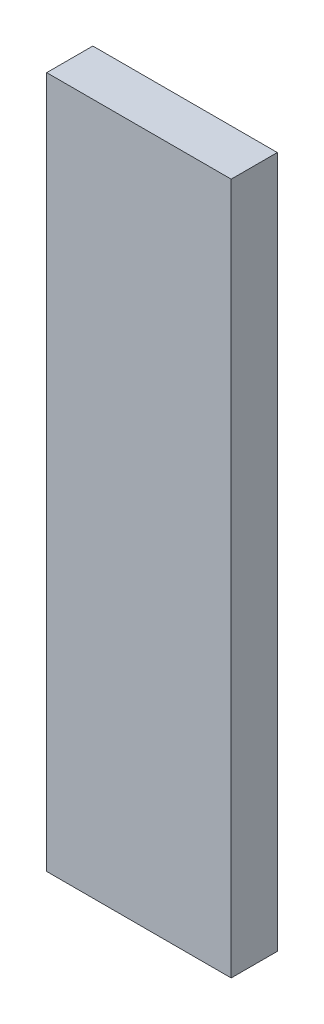
ISO-10303-21;
HEADER;
FILE_DESCRIPTION(('STEP AP214'),'2;1');
FILE_NAME('part.step','',(''),(''),'','','');
FILE_SCHEMA(('AUTOMOTIVE_DESIGN { 1 0 10303 214 1 1 1 1 }'));
ENDSEC;
DATA;
#1=APPLICATION_CONTEXT('core data for automotive mechanical design processes');
#2=APPLICATION_PROTOCOL_DEFINITION('international standard','automotive_design',2000,#1);
#3=PRODUCT_CONTEXT('',#1,'mechanical');
#4=PRODUCT('Part','Part','',(#3));
#5=PRODUCT_RELATED_PRODUCT_CATEGORY('part','',(#4));
#6=PRODUCT_DEFINITION_FORMATION('','',#4);
#7=PRODUCT_DEFINITION_CONTEXT('part definition',#1,'design');
#8=PRODUCT_DEFINITION('design','',#6,#7);
#9=PRODUCT_DEFINITION_SHAPE('','',#8);
#10=(LENGTH_UNIT() NAMED_UNIT(*) SI_UNIT(.MILLI.,.METRE.));
#11=(NAMED_UNIT(*) PLANE_ANGLE_UNIT() SI_UNIT($,.RADIAN.));
#12=(NAMED_UNIT(*) SI_UNIT($,.STERADIAN.) SOLID_ANGLE_UNIT());
#13=UNCERTAINTY_MEASURE_WITH_UNIT(LENGTH_MEASURE(1.E-05),#10,'distance_accuracy_value','');
#14=(GEOMETRIC_REPRESENTATION_CONTEXT(3) GLOBAL_UNCERTAINTY_ASSIGNED_CONTEXT((#13)) GLOBAL_UNIT_ASSIGNED_CONTEXT((#10,
#11,#12)) REPRESENTATION_CONTEXT('',''));
#15=CARTESIAN_POINT('',(0.,0.,0.));
#16=DIRECTION('',(0.,0.,1.));
#17=DIRECTION('',(1.,0.,0.));
#18=AXIS2_PLACEMENT_3D('',#15,#16,#17);
#19=CARTESIAN_POINT('',(0.,0.,-0.5));
#20=DIRECTION('',(0.,0.,-1.));
#21=DIRECTION('',(-1.,0.,0.));
#22=AXIS2_PLACEMENT_3D('',#19,#20,#21);
#23=PLANE('',#22);
#24=DIRECTION('',(1.,0.,0.));
#25=VECTOR('',#24,1.);
#26=CARTESIAN_POINT('',(2.,7.5,-0.5));
#27=LINE('',#26,#25);
#28=CARTESIAN_POINT('',(2.,7.5,-0.5));
#29=VERTEX_POINT('',#28);
#30=CARTESIAN_POINT('',(-2.,7.5,-0.5));
#31=VERTEX_POINT('',#30);
#32=EDGE_CURVE('E68',#29,#31,#27,.F.);
#33=ORIENTED_EDGE('',*,*,#32,.F.);
#34=DIRECTION('',(0.,1.,0.));
#35=VECTOR('',#34,1.);
#36=CARTESIAN_POINT('',(2.,-7.5,-0.5));
#37=LINE('',#36,#35);
#38=CARTESIAN_POINT('',(2.,-7.5,-0.5));
#39=VERTEX_POINT('',#38);
#40=EDGE_CURVE('E55',#39,#29,#37,.T.);
#41=ORIENTED_EDGE('',*,*,#40,.F.);
#42=DIRECTION('',(1.,0.,0.));
#43=VECTOR('',#42,1.);
#44=CARTESIAN_POINT('',(-2.,-7.5,-0.5));
#45=LINE('',#44,#43);
#46=CARTESIAN_POINT('',(-2.,-7.5,-0.5));
#47=VERTEX_POINT('',#46);
#48=EDGE_CURVE('E20',#47,#39,#45,.T.);
#49=ORIENTED_EDGE('',*,*,#48,.F.);
#50=DIRECTION('',(0.,-1.,0.));
#51=VECTOR('',#50,1.);
#52=CARTESIAN_POINT('',(-2.,7.5,-0.5));
#53=LINE('',#52,#51);
#54=EDGE_CURVE('E80',#31,#47,#53,.T.);
#55=ORIENTED_EDGE('',*,*,#54,.F.);
#56=EDGE_LOOP('',(#33,#41,#49,#55));
#57=FACE_BOUND('',#56,.T.);
#58=ADVANCED_FACE('F17',(#57),#23,.T.);
#59=CARTESIAN_POINT('',(-2.,-7.5,0.));
#60=DIRECTION('',(0.,-1.,0.));
#61=DIRECTION('',(0.,0.,-1.));
#62=AXIS2_PLACEMENT_3D('',#59,#60,#61);
#63=PLANE('',#62);
#64=DIRECTION('',(0.,0.,1.));
#65=VECTOR('',#64,1.);
#66=CARTESIAN_POINT('',(2.,-7.5,0.));
#67=LINE('',#66,#65);
#68=CARTESIAN_POINT('',(2.,-7.5,0.5));
#69=VERTEX_POINT('',#68);
#70=EDGE_CURVE('E61',#69,#39,#67,.F.);
#71=ORIENTED_EDGE('',*,*,#70,.F.);
#72=DIRECTION('',(1.,0.,0.));
#73=VECTOR('',#72,1.);
#74=CARTESIAN_POINT('',(0.,-7.5,0.5));
#75=LINE('',#74,#73);
#76=CARTESIAN_POINT('',(-2.,-7.5,0.5));
#77=VERTEX_POINT('',#76);
#78=EDGE_CURVE('E83',#77,#69,#75,.T.);
#79=ORIENTED_EDGE('',*,*,#78,.F.);
#80=DIRECTION('',(0.,0.,1.));
#81=VECTOR('',#80,1.);
#82=CARTESIAN_POINT('',(-2.,-7.5,0.));
#83=LINE('',#82,#81);
#84=EDGE_CURVE('E64',#47,#77,#83,.T.);
#85=ORIENTED_EDGE('',*,*,#84,.F.);
#86=ORIENTED_EDGE('',*,*,#48,.T.);
#87=EDGE_LOOP('',(#71,#79,#85,#86));
#88=FACE_BOUND('',#87,.T.);
#89=ADVANCED_FACE('F60',(#88),#63,.T.);
#90=CARTESIAN_POINT('',(2.,-7.5,0.));
#91=DIRECTION('',(1.,0.,0.));
#92=DIRECTION('',(0.,1.,0.));
#93=AXIS2_PLACEMENT_3D('',#90,#91,#92);
#94=PLANE('',#93);
#95=DIRECTION('',(0.,0.,1.));
#96=VECTOR('',#95,1.);
#97=CARTESIAN_POINT('',(2.,7.5,0.));
#98=LINE('',#97,#96);
#99=CARTESIAN_POINT('',(2.,7.5,0.5));
#100=VERTEX_POINT('',#99);
#101=EDGE_CURVE('E70',#100,#29,#98,.F.);
#102=ORIENTED_EDGE('',*,*,#101,.F.);
#103=DIRECTION('',(0.,1.,0.));
#104=VECTOR('',#103,1.);
#105=CARTESIAN_POINT('',(2.,0.,0.5));
#106=LINE('',#105,#104);
#107=EDGE_CURVE('E74',#69,#100,#106,.T.);
#108=ORIENTED_EDGE('',*,*,#107,.F.);
#109=ORIENTED_EDGE('',*,*,#70,.T.);
#110=ORIENTED_EDGE('',*,*,#40,.T.);
#111=EDGE_LOOP('',(#102,#108,#109,#110));
#112=FACE_BOUND('',#111,.T.);
#113=ADVANCED_FACE('F72',(#112),#94,.T.);
#114=CARTESIAN_POINT('',(2.,7.5,0.));
#115=DIRECTION('',(0.,1.,0.));
#116=DIRECTION('',(0.,0.,1.));
#117=AXIS2_PLACEMENT_3D('',#114,#115,#116);
#118=PLANE('',#117);
#119=DIRECTION('',(0.,0.,1.));
#120=VECTOR('',#119,1.);
#121=CARTESIAN_POINT('',(-2.,7.5,0.));
#122=LINE('',#121,#120);
#123=CARTESIAN_POINT('',(-2.,7.5,0.5));
#124=VERTEX_POINT('',#123);
#125=EDGE_CURVE('E35',#124,#31,#122,.F.);
#126=ORIENTED_EDGE('',*,*,#125,.F.);
#127=DIRECTION('',(1.,0.,0.));
#128=VECTOR('',#127,1.);
#129=CARTESIAN_POINT('',(0.,7.5,0.5));
#130=LINE('',#129,#128);
#131=EDGE_CURVE('E26',#100,#124,#130,.F.);
#132=ORIENTED_EDGE('',*,*,#131,.F.);
#133=ORIENTED_EDGE('',*,*,#101,.T.);
#134=ORIENTED_EDGE('',*,*,#32,.T.);
#135=EDGE_LOOP('',(#126,#132,#133,#134));
#136=FACE_BOUND('',#135,.T.);
#137=ADVANCED_FACE('F89',(#136),#118,.T.);
#138=CARTESIAN_POINT('',(-2.,7.5,0.));
#139=DIRECTION('',(-1.,0.,0.));
#140=DIRECTION('',(0.,-1.,0.));
#141=AXIS2_PLACEMENT_3D('',#138,#139,#140);
#142=PLANE('',#141);
#143=ORIENTED_EDGE('',*,*,#84,.T.);
#144=DIRECTION('',(0.,1.,0.));
#145=VECTOR('',#144,1.);
#146=CARTESIAN_POINT('',(-2.,0.,0.5));
#147=LINE('',#146,#145);
#148=EDGE_CURVE('E11',#124,#77,#147,.F.);
#149=ORIENTED_EDGE('',*,*,#148,.F.);
#150=ORIENTED_EDGE('',*,*,#125,.T.);
#151=ORIENTED_EDGE('',*,*,#54,.T.);
#152=EDGE_LOOP('',(#143,#149,#150,#151));
#153=FACE_BOUND('',#152,.T.);
#154=ADVANCED_FACE('F91',(#153),#142,.T.);
#155=CARTESIAN_POINT('',(0.,0.,0.5));
#156=DIRECTION('',(0.,0.,1.));
#157=DIRECTION('',(1.,0.,0.));
#158=AXIS2_PLACEMENT_3D('',#155,#156,#157);
#159=PLANE('',#158);
#160=ORIENTED_EDGE('',*,*,#131,.T.);
#161=ORIENTED_EDGE('',*,*,#148,.T.);
#162=ORIENTED_EDGE('',*,*,#78,.T.);
#163=ORIENTED_EDGE('',*,*,#107,.T.);
#164=EDGE_LOOP('',(#160,#161,#162,#163));
#165=FACE_BOUND('',#164,.T.);
#166=ADVANCED_FACE('F88',(#165),#159,.T.);
#167=CLOSED_SHELL('',(#58,#89,#113,#137,#154,#166));
#168=MANIFOLD_SOLID_BREP('B1',#167);
#169=ADVANCED_BREP_SHAPE_REPRESENTATION('',(#18,#168),#14);
#170=SHAPE_DEFINITION_REPRESENTATION(#9,#169);
ENDSEC;
END-ISO-10303-21;
